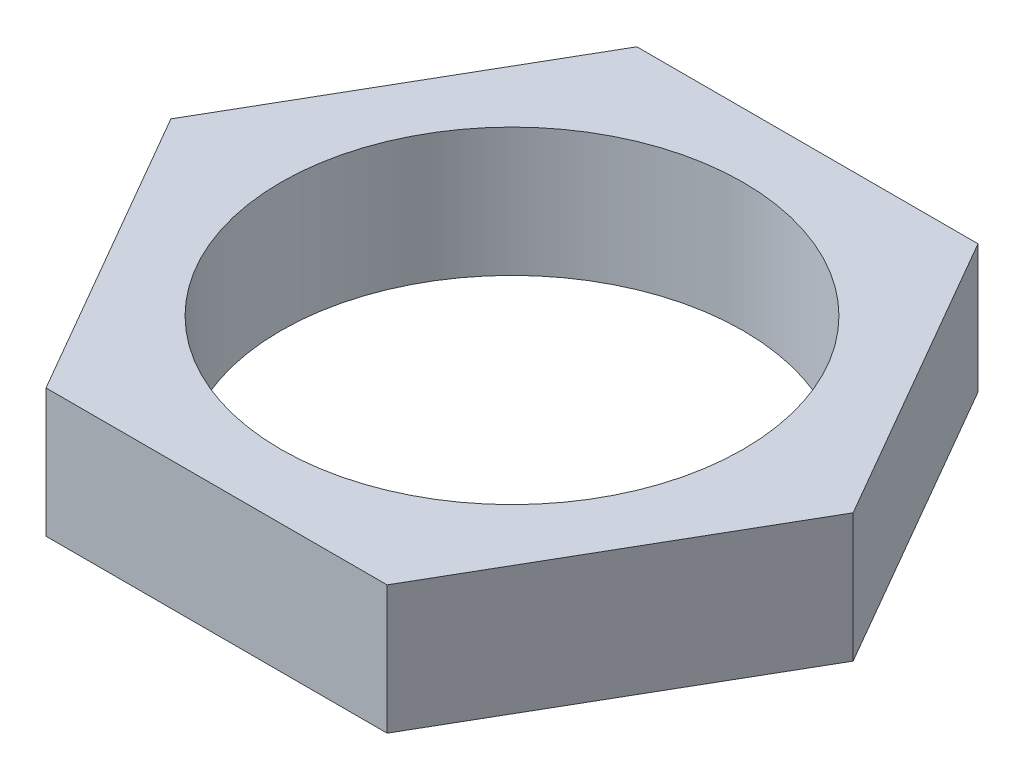
ISO-10303-21;
HEADER;
FILE_DESCRIPTION(('STEP AP214'),'2;1');
FILE_NAME('part.step','',(''),(''),'','','');
FILE_SCHEMA(('AUTOMOTIVE_DESIGN { 1 0 10303 214 1 1 1 1 }'));
ENDSEC;
DATA;
#1=APPLICATION_CONTEXT('core data for automotive mechanical design processes');
#2=APPLICATION_PROTOCOL_DEFINITION('international standard','automotive_design',2000,#1);
#3=PRODUCT_CONTEXT('',#1,'mechanical');
#4=PRODUCT('Part','Part','',(#3));
#5=PRODUCT_RELATED_PRODUCT_CATEGORY('part','',(#4));
#6=PRODUCT_DEFINITION_FORMATION('','',#4);
#7=PRODUCT_DEFINITION_CONTEXT('part definition',#1,'design');
#8=PRODUCT_DEFINITION('design','',#6,#7);
#9=PRODUCT_DEFINITION_SHAPE('','',#8);
#10=(LENGTH_UNIT() NAMED_UNIT(*) SI_UNIT(.MILLI.,.METRE.));
#11=(NAMED_UNIT(*) PLANE_ANGLE_UNIT() SI_UNIT($,.RADIAN.));
#12=(NAMED_UNIT(*) SI_UNIT($,.STERADIAN.) SOLID_ANGLE_UNIT());
#13=UNCERTAINTY_MEASURE_WITH_UNIT(LENGTH_MEASURE(1.E-05),#10,'distance_accuracy_value','');
#14=(GEOMETRIC_REPRESENTATION_CONTEXT(3) GLOBAL_UNCERTAINTY_ASSIGNED_CONTEXT((#13)) GLOBAL_UNIT_ASSIGNED_CONTEXT((#10,
#11,#12)) REPRESENTATION_CONTEXT('',''));
#15=CARTESIAN_POINT('',(0.,0.,0.));
#16=DIRECTION('',(0.,0.,1.));
#17=DIRECTION('',(1.,0.,0.));
#18=AXIS2_PLACEMENT_3D('',#15,#16,#17);
#19=CARTESIAN_POINT('',(0.,5.,0.));
#20=DIRECTION('',(0.,1.,0.));
#21=DIRECTION('',(0.,0.,1.));
#22=AXIS2_PLACEMENT_3D('',#19,#20,#21);
#23=PLANE('',#22);
#24=DIRECTION('',(0.499999999999995,0.,-0.866025403784442));
#25=VECTOR('',#24,1.);
#26=CARTESIAN_POINT('',(6.63952809568084,5.,11.4999999999999));
#27=LINE('',#26,#25);
#28=CARTESIAN_POINT('',(6.63952809568084,5.,11.4999999999999));
#29=VERTEX_POINT('',#28);
#30=CARTESIAN_POINT('',(13.2790561913614,5.,0.));
#31=VERTEX_POINT('',#30);
#32=EDGE_CURVE('E128',#29,#31,#27,.T.);
#33=ORIENTED_EDGE('',*,*,#32,.T.);
#34=DIRECTION('',(-0.500000000000001,0.,-0.866025403784438));
#35=VECTOR('',#34,1.);
#36=CARTESIAN_POINT('',(13.2790561913614,5.,0.));
#37=LINE('',#36,#35);
#38=CARTESIAN_POINT('',(6.63952809568067,5.,-11.5));
#39=VERTEX_POINT('',#38);
#40=EDGE_CURVE('E86',#31,#39,#37,.T.);
#41=ORIENTED_EDGE('',*,*,#40,.T.);
#42=DIRECTION('',(-1.,0.,0.));
#43=VECTOR('',#42,1.);
#44=CARTESIAN_POINT('',(6.63952809568067,5.,-11.5));
#45=LINE('',#44,#43);
#46=CARTESIAN_POINT('',(-6.63952809568075,5.,-11.5));
#47=VERTEX_POINT('',#46);
#48=EDGE_CURVE('E99',#39,#47,#45,.T.);
#49=ORIENTED_EDGE('',*,*,#48,.T.);
#50=DIRECTION('',(-0.499999999999995,0.,0.866025403784441));
#51=VECTOR('',#50,1.);
#52=CARTESIAN_POINT('',(-6.63952809568075,5.,-11.5));
#53=LINE('',#52,#51);
#54=CARTESIAN_POINT('',(-13.2790561913614,5.,0.));
#55=VERTEX_POINT('',#54);
#56=EDGE_CURVE('E93',#47,#55,#53,.T.);
#57=ORIENTED_EDGE('',*,*,#56,.T.);
#58=DIRECTION('',(0.500000000000007,0.,0.866025403784435));
#59=VECTOR('',#58,1.);
#60=CARTESIAN_POINT('',(-13.2790561913614,5.,0.));
#61=LINE('',#60,#59);
#62=CARTESIAN_POINT('',(-6.63952809568059,5.,11.5000000000001));
#63=VERTEX_POINT('',#62);
#64=EDGE_CURVE('E97',#55,#63,#61,.T.);
#65=ORIENTED_EDGE('',*,*,#64,.T.);
#66=DIRECTION('',(1.,0.,0.));
#67=VECTOR('',#66,1.);
#68=CARTESIAN_POINT('',(-6.63952809568059,5.,11.5000000000001));
#69=LINE('',#68,#67);
#70=EDGE_CURVE('E49',#63,#29,#69,.T.);
#71=ORIENTED_EDGE('',*,*,#70,.T.);
#72=EDGE_LOOP('',(#33,#41,#49,#57,#65,#71));
#73=FACE_BOUND('',#72,.T.);
#74=CARTESIAN_POINT('',(0.,5.,0.));
#75=DIRECTION('',(0.,1.,0.));
#76=DIRECTION('',(0.,0.,1.));
#77=AXIS2_PLACEMENT_3D('',#74,#75,#76);
#78=CIRCLE('',#77,9.);
#79=CARTESIAN_POINT('',(0.,5.,9.));
#80=VERTEX_POINT('',#79);
#81=EDGE_CURVE('E121',#80,#80,#78,.T.);
#82=ORIENTED_EDGE('',*,*,#81,.F.);
#83=EDGE_LOOP('',(#82));
#84=FACE_BOUND('',#83,.T.);
#85=ADVANCED_FACE('F32',(#73,#84),#23,.T.);
#86=CARTESIAN_POINT('',(0.,0.,0.));
#87=DIRECTION('',(0.,1.,0.));
#88=DIRECTION('',(0.,0.,1.));
#89=AXIS2_PLACEMENT_3D('',#86,#87,#88);
#90=PLANE('',#89);
#91=DIRECTION('',(0.499999999999995,0.,-0.866025403784442));
#92=VECTOR('',#91,1.);
#93=CARTESIAN_POINT('',(6.63952809568084,0.,11.4999999999999));
#94=LINE('',#93,#92);
#95=CARTESIAN_POINT('',(6.63952809568084,0.,11.4999999999999));
#96=VERTEX_POINT('',#95);
#97=CARTESIAN_POINT('',(13.2790561913614,0.,0.));
#98=VERTEX_POINT('',#97);
#99=EDGE_CURVE('E117',#96,#98,#94,.T.);
#100=ORIENTED_EDGE('',*,*,#99,.F.);
#101=DIRECTION('',(1.,0.,0.));
#102=VECTOR('',#101,1.);
#103=CARTESIAN_POINT('',(-6.63952809568059,0.,11.5000000000001));
#104=LINE('',#103,#102);
#105=CARTESIAN_POINT('',(-6.63952809568059,0.,11.5000000000001));
#106=VERTEX_POINT('',#105);
#107=EDGE_CURVE('E78',#106,#96,#104,.T.);
#108=ORIENTED_EDGE('',*,*,#107,.F.);
#109=DIRECTION('',(0.500000000000007,0.,0.866025403784435));
#110=VECTOR('',#109,1.);
#111=CARTESIAN_POINT('',(-13.2790561913614,0.,0.));
#112=LINE('',#111,#110);
#113=CARTESIAN_POINT('',(-13.2790561913614,0.,0.));
#114=VERTEX_POINT('',#113);
#115=EDGE_CURVE('E72',#114,#106,#112,.T.);
#116=ORIENTED_EDGE('',*,*,#115,.F.);
#117=DIRECTION('',(-0.499999999999995,0.,0.866025403784441));
#118=VECTOR('',#117,1.);
#119=CARTESIAN_POINT('',(-6.63952809568075,0.,-11.5));
#120=LINE('',#119,#118);
#121=CARTESIAN_POINT('',(-6.63952809568075,0.,-11.5));
#122=VERTEX_POINT('',#121);
#123=EDGE_CURVE('E107',#122,#114,#120,.T.);
#124=ORIENTED_EDGE('',*,*,#123,.F.);
#125=DIRECTION('',(-1.,0.,0.));
#126=VECTOR('',#125,1.);
#127=CARTESIAN_POINT('',(6.63952809568067,0.,-11.5));
#128=LINE('',#127,#126);
#129=CARTESIAN_POINT('',(6.63952809568067,0.,-11.5));
#130=VERTEX_POINT('',#129);
#131=EDGE_CURVE('E123',#130,#122,#128,.T.);
#132=ORIENTED_EDGE('',*,*,#131,.F.);
#133=DIRECTION('',(-0.500000000000001,0.,-0.866025403784438));
#134=VECTOR('',#133,1.);
#135=CARTESIAN_POINT('',(13.2790561913614,0.,0.));
#136=LINE('',#135,#134);
#137=EDGE_CURVE('E120',#98,#130,#136,.T.);
#138=ORIENTED_EDGE('',*,*,#137,.F.);
#139=EDGE_LOOP('',(#100,#108,#116,#124,#132,#138));
#140=FACE_BOUND('',#139,.T.);
#141=CARTESIAN_POINT('',(0.,0.,0.));
#142=DIRECTION('',(0.,1.,0.));
#143=DIRECTION('',(0.,0.,1.));
#144=AXIS2_PLACEMENT_3D('',#141,#142,#143);
#145=CIRCLE('',#144,9.);
#146=CARTESIAN_POINT('',(0.,0.,9.));
#147=VERTEX_POINT('',#146);
#148=EDGE_CURVE('E221',#147,#147,#145,.T.);
#149=ORIENTED_EDGE('',*,*,#148,.T.);
#150=EDGE_LOOP('',(#149));
#151=FACE_BOUND('',#150,.T.);
#152=ADVANCED_FACE('F137',(#140,#151),#90,.F.);
#153=CARTESIAN_POINT('',(6.63952809568084,5.,11.4999999999999));
#154=DIRECTION('',(-0.866025403784442,0.,-0.499999999999995));
#155=DIRECTION('',(-0.499999999999995,0.,0.866025403784442));
#156=AXIS2_PLACEMENT_3D('',#153,#154,#155);
#157=PLANE('',#156);
#158=ORIENTED_EDGE('',*,*,#99,.T.);
#159=DIRECTION('',(0.,-1.,0.));
#160=VECTOR('',#159,1.);
#161=CARTESIAN_POINT('',(13.2790561913614,5.,0.));
#162=LINE('',#161,#160);
#163=EDGE_CURVE('E11',#31,#98,#162,.T.);
#164=ORIENTED_EDGE('',*,*,#163,.F.);
#165=ORIENTED_EDGE('',*,*,#32,.F.);
#166=DIRECTION('',(0.,-1.,0.));
#167=VECTOR('',#166,1.);
#168=CARTESIAN_POINT('',(6.63952809568084,5.,11.4999999999999));
#169=LINE('',#168,#167);
#170=EDGE_CURVE('E113',#29,#96,#169,.T.);
#171=ORIENTED_EDGE('',*,*,#170,.T.);
#172=EDGE_LOOP('',(#158,#164,#165,#171));
#173=FACE_BOUND('',#172,.T.);
#174=ADVANCED_FACE('F34',(#173),#157,.F.);
#175=CARTESIAN_POINT('',(13.2790561913614,5.,0.));
#176=DIRECTION('',(-0.866025403784438,0.,0.500000000000001));
#177=DIRECTION('',(0.500000000000001,0.,0.866025403784438));
#178=AXIS2_PLACEMENT_3D('',#175,#176,#177);
#179=PLANE('',#178);
#180=ORIENTED_EDGE('',*,*,#137,.T.);
#181=DIRECTION('',(0.,-1.,0.));
#182=VECTOR('',#181,1.);
#183=CARTESIAN_POINT('',(6.63952809568067,5.,-11.5));
#184=LINE('',#183,#182);
#185=EDGE_CURVE('E41',#39,#130,#184,.T.);
#186=ORIENTED_EDGE('',*,*,#185,.F.);
#187=ORIENTED_EDGE('',*,*,#40,.F.);
#188=ORIENTED_EDGE('',*,*,#163,.T.);
#189=EDGE_LOOP('',(#180,#186,#187,#188));
#190=FACE_BOUND('',#189,.T.);
#191=ADVANCED_FACE('F162',(#190),#179,.F.);
#192=CARTESIAN_POINT('',(6.63952809568067,5.,-11.5));
#193=DIRECTION('',(0.,0.,1.));
#194=DIRECTION('',(1.,0.,0.));
#195=AXIS2_PLACEMENT_3D('',#192,#193,#194);
#196=PLANE('',#195);
#197=ORIENTED_EDGE('',*,*,#131,.T.);
#198=DIRECTION('',(0.,-1.,0.));
#199=VECTOR('',#198,1.);
#200=CARTESIAN_POINT('',(-6.63952809568075,5.,-11.5));
#201=LINE('',#200,#199);
#202=EDGE_CURVE('E108',#47,#122,#201,.T.);
#203=ORIENTED_EDGE('',*,*,#202,.F.);
#204=ORIENTED_EDGE('',*,*,#48,.F.);
#205=ORIENTED_EDGE('',*,*,#185,.T.);
#206=EDGE_LOOP('',(#197,#203,#204,#205));
#207=FACE_BOUND('',#206,.T.);
#208=ADVANCED_FACE('F134',(#207),#196,.F.);
#209=CARTESIAN_POINT('',(-6.63952809568075,5.,-11.5));
#210=DIRECTION('',(0.866025403784441,0.,0.499999999999995));
#211=DIRECTION('',(0.499999999999995,0.,-0.866025403784441));
#212=AXIS2_PLACEMENT_3D('',#209,#210,#211);
#213=PLANE('',#212);
#214=ORIENTED_EDGE('',*,*,#123,.T.);
#215=DIRECTION('',(0.,-1.,0.));
#216=VECTOR('',#215,1.);
#217=CARTESIAN_POINT('',(-13.2790561913614,5.,0.));
#218=LINE('',#217,#216);
#219=EDGE_CURVE('E104',#55,#114,#218,.T.);
#220=ORIENTED_EDGE('',*,*,#219,.F.);
#221=ORIENTED_EDGE('',*,*,#56,.F.);
#222=ORIENTED_EDGE('',*,*,#202,.T.);
#223=EDGE_LOOP('',(#214,#220,#221,#222));
#224=FACE_BOUND('',#223,.T.);
#225=ADVANCED_FACE('F105',(#224),#213,.F.);
#226=CARTESIAN_POINT('',(-13.2790561913614,5.,0.));
#227=DIRECTION('',(0.866025403784434,0.,-0.500000000000007));
#228=DIRECTION('',(-0.500000000000007,0.,-0.866025403784435));
#229=AXIS2_PLACEMENT_3D('',#226,#227,#228);
#230=PLANE('',#229);
#231=ORIENTED_EDGE('',*,*,#115,.T.);
#232=DIRECTION('',(0.,-1.,0.));
#233=VECTOR('',#232,1.);
#234=CARTESIAN_POINT('',(-6.63952809568059,5.,11.5000000000001));
#235=LINE('',#234,#233);
#236=EDGE_CURVE('E109',#63,#106,#235,.T.);
#237=ORIENTED_EDGE('',*,*,#236,.F.);
#238=ORIENTED_EDGE('',*,*,#64,.F.);
#239=ORIENTED_EDGE('',*,*,#219,.T.);
#240=EDGE_LOOP('',(#231,#237,#238,#239));
#241=FACE_BOUND('',#240,.T.);
#242=ADVANCED_FACE('F111',(#241),#230,.F.);
#243=CARTESIAN_POINT('',(-6.63952809568059,5.,11.5000000000001));
#244=DIRECTION('',(0.,0.,-1.));
#245=DIRECTION('',(-1.,0.,0.));
#246=AXIS2_PLACEMENT_3D('',#243,#244,#245);
#247=PLANE('',#246);
#248=ORIENTED_EDGE('',*,*,#107,.T.);
#249=ORIENTED_EDGE('',*,*,#170,.F.);
#250=ORIENTED_EDGE('',*,*,#70,.F.);
#251=ORIENTED_EDGE('',*,*,#236,.T.);
#252=EDGE_LOOP('',(#248,#249,#250,#251));
#253=FACE_BOUND('',#252,.T.);
#254=ADVANCED_FACE('F142',(#253),#247,.F.);
#255=CARTESIAN_POINT('',(0.,5.,0.));
#256=DIRECTION('',(0.,-1.,0.));
#257=DIRECTION('',(0.,0.,-1.));
#258=AXIS2_PLACEMENT_3D('',#255,#256,#257);
#259=CYLINDRICAL_SURFACE('',#258,9.);
#260=ORIENTED_EDGE('',*,*,#81,.T.);
#261=EDGE_LOOP('',(#260));
#262=FACE_BOUND('',#261,.T.);
#263=ORIENTED_EDGE('',*,*,#148,.F.);
#264=EDGE_LOOP('',(#263));
#265=FACE_BOUND('',#264,.T.);
#266=ADVANCED_FACE('F144',(#262,#265),#259,.F.);
#267=CLOSED_SHELL('',(#85,#152,#174,#191,#208,#225,#242,#254,#266));
#268=MANIFOLD_SOLID_BREP('B2',#267);
#269=ADVANCED_BREP_SHAPE_REPRESENTATION('',(#18,#268),#14);
#270=SHAPE_DEFINITION_REPRESENTATION(#9,#269);
ENDSEC;
END-ISO-10303-21;
